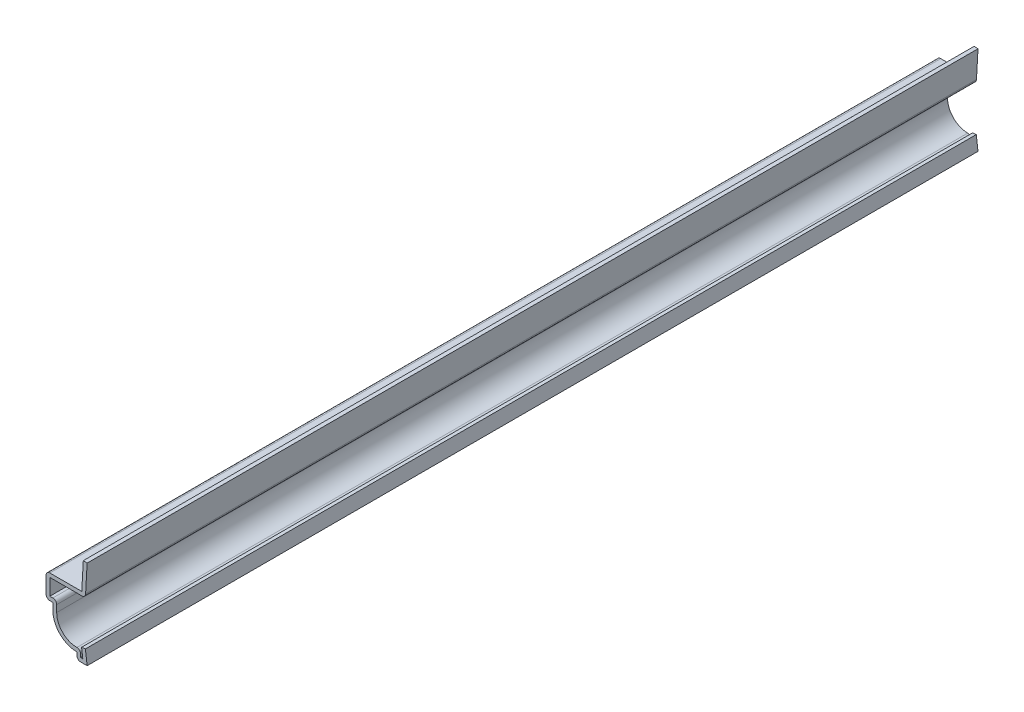
ISO-10303-21;
HEADER;
FILE_DESCRIPTION(('STEP AP214'),'2;1');
FILE_NAME('part.step','',(''),(''),'','','');
FILE_SCHEMA(('AUTOMOTIVE_DESIGN { 1 0 10303 214 1 1 1 1 }'));
ENDSEC;
DATA;
#1=APPLICATION_CONTEXT('core data for automotive mechanical design processes');
#2=APPLICATION_PROTOCOL_DEFINITION('international standard','automotive_design',2000,#1);
#3=PRODUCT_CONTEXT('',#1,'mechanical');
#4=PRODUCT('Part','Part','',(#3));
#5=PRODUCT_RELATED_PRODUCT_CATEGORY('part','',(#4));
#6=PRODUCT_DEFINITION_FORMATION('','',#4);
#7=PRODUCT_DEFINITION_CONTEXT('part definition',#1,'design');
#8=PRODUCT_DEFINITION('design','',#6,#7);
#9=PRODUCT_DEFINITION_SHAPE('','',#8);
#10=(LENGTH_UNIT() NAMED_UNIT(*) SI_UNIT(.MILLI.,.METRE.));
#11=(NAMED_UNIT(*) PLANE_ANGLE_UNIT() SI_UNIT($,.RADIAN.));
#12=(NAMED_UNIT(*) SI_UNIT($,.STERADIAN.) SOLID_ANGLE_UNIT());
#13=UNCERTAINTY_MEASURE_WITH_UNIT(LENGTH_MEASURE(1.E-05),#10,'distance_accuracy_value','');
#14=(GEOMETRIC_REPRESENTATION_CONTEXT(3) GLOBAL_UNCERTAINTY_ASSIGNED_CONTEXT((#13)) GLOBAL_UNIT_ASSIGNED_CONTEXT((#10,
#11,#12)) REPRESENTATION_CONTEXT('',''));
#15=CARTESIAN_POINT('',(0.,0.,0.));
#16=DIRECTION('',(0.,0.,1.));
#17=DIRECTION('',(1.,0.,0.));
#18=AXIS2_PLACEMENT_3D('',#15,#16,#17);
#19=CARTESIAN_POINT('',(-0.396875,3.175,-206.375));
#20=DIRECTION('',(-0.124034734589209,0.992277876713668,0.));
#21=DIRECTION('',(-0.992277876713668,-0.124034734589209,0.));
#22=AXIS2_PLACEMENT_3D('',#19,#20,#21);
#23=PLANE('',#22);
#24=DIRECTION('',(-0.992277876713668,-0.124034734589209,0.));
#25=VECTOR('',#24,1.);
#26=CARTESIAN_POINT('',(-0.396875,3.175,0.));
#27=LINE('',#26,#25);
#28=CARTESIAN_POINT('',(-0.396875,3.175,0.));
#29=VERTEX_POINT('',#28);
#30=CARTESIAN_POINT('',(-1.27901003239845,3.06473312095019,0.));
#31=VERTEX_POINT('',#30);
#32=EDGE_CURVE('E284',#29,#31,#27,.T.);
#33=ORIENTED_EDGE('',*,*,#32,.F.);
#34=DIRECTION('',(0.,0.,1.));
#35=VECTOR('',#34,1.);
#36=CARTESIAN_POINT('',(-0.396875,3.175,-206.375));
#37=LINE('',#36,#35);
#38=CARTESIAN_POINT('',(-0.396875,3.175,-206.375));
#39=VERTEX_POINT('',#38);
#40=EDGE_CURVE('E233',#39,#29,#37,.T.);
#41=ORIENTED_EDGE('',*,*,#40,.F.);
#42=DIRECTION('',(-0.992277876713668,-0.124034734589209,0.));
#43=VECTOR('',#42,1.);
#44=CARTESIAN_POINT('',(-0.396875,3.175,-206.375));
#45=LINE('',#44,#43);
#46=CARTESIAN_POINT('',(-1.27901003239845,3.06473312095019,-206.375));
#47=VERTEX_POINT('',#46);
#48=EDGE_CURVE('E227',#39,#47,#45,.T.);
#49=ORIENTED_EDGE('',*,*,#48,.T.);
#50=DIRECTION('',(0.,0.,1.));
#51=VECTOR('',#50,1.);
#52=CARTESIAN_POINT('',(-1.27901003239845,3.06473312095019,-206.375));
#53=LINE('',#52,#51);
#54=EDGE_CURVE('E209',#47,#31,#53,.T.);
#55=ORIENTED_EDGE('',*,*,#54,.T.);
#56=EDGE_LOOP('',(#33,#41,#49,#55));
#57=FACE_BOUND('',#56,.T.);
#58=ADVANCED_FACE('F35',(#57),#23,.T.);
#59=CARTESIAN_POINT('',(-0.396875,3.175,-206.375));
#60=DIRECTION('',(0.992277876713668,0.124034734589209,0.));
#61=DIRECTION('',(-0.124034734589209,0.992277876713668,0.));
#62=AXIS2_PLACEMENT_3D('',#59,#60,#61);
#63=PLANE('',#62);
#64=DIRECTION('',(-0.124034734589209,0.992277876713668,0.));
#65=VECTOR('',#64,1.);
#66=CARTESIAN_POINT('',(-0.396875,3.175,0.));
#67=LINE('',#66,#65);
#68=CARTESIAN_POINT('',(0.,0.,0.));
#69=VERTEX_POINT('',#68);
#70=EDGE_CURVE('E234',#69,#29,#67,.T.);
#71=ORIENTED_EDGE('',*,*,#70,.F.);
#72=DIRECTION('',(0.,0.,1.));
#73=VECTOR('',#72,1.);
#74=CARTESIAN_POINT('',(0.,0.,-206.375));
#75=LINE('',#74,#73);
#76=CARTESIAN_POINT('',(0.,0.,-206.375));
#77=VERTEX_POINT('',#76);
#78=EDGE_CURVE('E334',#77,#69,#75,.T.);
#79=ORIENTED_EDGE('',*,*,#78,.F.);
#80=DIRECTION('',(-0.124034734589209,0.992277876713668,0.));
#81=VECTOR('',#80,1.);
#82=CARTESIAN_POINT('',(-0.396875,3.175,-206.375));
#83=LINE('',#82,#81);
#84=EDGE_CURVE('E220',#77,#39,#83,.T.);
#85=ORIENTED_EDGE('',*,*,#84,.T.);
#86=ORIENTED_EDGE('',*,*,#40,.T.);
#87=EDGE_LOOP('',(#71,#79,#85,#86));
#88=FACE_BOUND('',#87,.T.);
#89=ADVANCED_FACE('F483',(#88),#63,.T.);
#90=CARTESIAN_POINT('',(0.,0.,-206.375));
#91=DIRECTION('',(0.,-1.,0.));
#92=DIRECTION('',(1.,0.,0.));
#93=AXIS2_PLACEMENT_3D('',#90,#91,#92);
#94=PLANE('',#93);
#95=DIRECTION('',(1.,0.,0.));
#96=VECTOR('',#95,1.);
#97=CARTESIAN_POINT('',(0.,0.,0.));
#98=LINE('',#97,#96);
#99=CARTESIAN_POINT('',(-1.49225,0.,0.));
#100=VERTEX_POINT('',#99);
#101=EDGE_CURVE('E237',#100,#69,#98,.T.);
#102=ORIENTED_EDGE('',*,*,#101,.F.);
#103=DIRECTION('',(0.,0.,1.));
#104=VECTOR('',#103,1.);
#105=CARTESIAN_POINT('',(-1.49225,0.,-206.375));
#106=LINE('',#105,#104);
#107=CARTESIAN_POINT('',(-1.49225,0.,-206.375));
#108=VERTEX_POINT('',#107);
#109=EDGE_CURVE('E392',#100,#108,#106,.F.);
#110=ORIENTED_EDGE('',*,*,#109,.T.);
#111=DIRECTION('',(1.,0.,0.));
#112=VECTOR('',#111,1.);
#113=CARTESIAN_POINT('',(0.,0.,-206.375));
#114=LINE('',#113,#112);
#115=EDGE_CURVE('E281',#108,#77,#114,.T.);
#116=ORIENTED_EDGE('',*,*,#115,.T.);
#117=ORIENTED_EDGE('',*,*,#78,.T.);
#118=EDGE_LOOP('',(#102,#110,#116,#117));
#119=FACE_BOUND('',#118,.T.);
#120=ADVANCED_FACE('F478',(#119),#94,.T.);
#121=CARTESIAN_POINT('',(-2.38125,0.,-206.375));
#122=DIRECTION('',(-1.,0.,0.));
#123=DIRECTION('',(0.,-1.,0.));
#124=AXIS2_PLACEMENT_3D('',#121,#122,#123);
#125=PLANE('',#124);
#126=DIRECTION('',(0.,-1.,0.));
#127=VECTOR('',#126,1.);
#128=CARTESIAN_POINT('',(-2.38125,0.,-206.375));
#129=LINE('',#128,#127);
#130=CARTESIAN_POINT('',(-2.38125,1.5875,-206.375));
#131=VERTEX_POINT('',#130);
#132=CARTESIAN_POINT('',(-2.38125,0.889,-206.375));
#133=VERTEX_POINT('',#132);
#134=EDGE_CURVE('E278',#131,#133,#129,.T.);
#135=ORIENTED_EDGE('',*,*,#134,.T.);
#136=DIRECTION('',(0.,0.,1.));
#137=VECTOR('',#136,1.);
#138=CARTESIAN_POINT('',(-2.38125,0.889,-206.375));
#139=LINE('',#138,#137);
#140=CARTESIAN_POINT('',(-2.38125,0.889,0.));
#141=VERTEX_POINT('',#140);
#142=EDGE_CURVE('E389',#133,#141,#139,.T.);
#143=ORIENTED_EDGE('',*,*,#142,.T.);
#144=DIRECTION('',(0.,-1.,0.));
#145=VECTOR('',#144,1.);
#146=CARTESIAN_POINT('',(-2.38125,0.,0.));
#147=LINE('',#146,#145);
#148=CARTESIAN_POINT('',(-2.38125,1.5875,0.));
#149=VERTEX_POINT('',#148);
#150=EDGE_CURVE('E328',#149,#141,#147,.T.);
#151=ORIENTED_EDGE('',*,*,#150,.F.);
#152=DIRECTION('',(0.,0.,1.));
#153=VECTOR('',#152,1.);
#154=CARTESIAN_POINT('',(-2.38125,1.5875,-206.375));
#155=LINE('',#154,#153);
#156=EDGE_CURVE('E337',#131,#149,#155,.T.);
#157=ORIENTED_EDGE('',*,*,#156,.F.);
#158=EDGE_LOOP('',(#135,#143,#151,#157));
#159=FACE_BOUND('',#158,.T.);
#160=ADVANCED_FACE('F470',(#159),#125,.T.);
#161=CARTESIAN_POINT('',(-2.38125,7.14375,-206.375));
#162=DIRECTION('',(0.,0.,1.));
#163=DIRECTION('',(1.,0.,0.));
#164=AXIS2_PLACEMENT_3D('',#161,#162,#163);
#165=CYLINDRICAL_SURFACE('',#164,5.55625);
#166=CARTESIAN_POINT('',(-2.38125,7.14375,0.));
#167=DIRECTION('',(0.,0.,1.));
#168=DIRECTION('',(-1.,0.,0.));
#169=AXIS2_PLACEMENT_3D('',#166,#167,#168);
#170=CIRCLE('',#169,5.55625);
#171=CARTESIAN_POINT('',(-7.9375,7.14375,0.));
#172=VERTEX_POINT('',#171);
#173=EDGE_CURVE('E325',#172,#149,#170,.T.);
#174=ORIENTED_EDGE('',*,*,#173,.F.);
#175=DIRECTION('',(0.,0.,1.));
#176=VECTOR('',#175,1.);
#177=CARTESIAN_POINT('',(-7.9375,7.14375,-206.375));
#178=LINE('',#177,#176);
#179=CARTESIAN_POINT('',(-7.9375,7.14375,-206.375));
#180=VERTEX_POINT('',#179);
#181=EDGE_CURVE('E339',#180,#172,#178,.T.);
#182=ORIENTED_EDGE('',*,*,#181,.F.);
#183=CARTESIAN_POINT('',(-2.38125,7.14375,-206.375));
#184=DIRECTION('',(0.,0.,1.));
#185=DIRECTION('',(-1.,0.,0.));
#186=AXIS2_PLACEMENT_3D('',#183,#184,#185);
#187=CIRCLE('',#186,5.55625);
#188=EDGE_CURVE('E275',#180,#131,#187,.T.);
#189=ORIENTED_EDGE('',*,*,#188,.T.);
#190=ORIENTED_EDGE('',*,*,#156,.T.);
#191=EDGE_LOOP('',(#174,#182,#189,#190));
#192=FACE_BOUND('',#191,.T.);
#193=ADVANCED_FACE('F466',(#192),#165,.T.);
#194=CARTESIAN_POINT('',(-7.9375,7.14375,-206.375));
#195=DIRECTION('',(-1.,0.,0.));
#196=DIRECTION('',(0.,-1.,0.));
#197=AXIS2_PLACEMENT_3D('',#194,#195,#196);
#198=PLANE('',#197);
#199=DIRECTION('',(0.,-1.,0.));
#200=VECTOR('',#199,1.);
#201=CARTESIAN_POINT('',(-7.9375,7.14375,0.));
#202=LINE('',#201,#200);
#203=CARTESIAN_POINT('',(-7.9375,8.73125,0.));
#204=VERTEX_POINT('',#203);
#205=EDGE_CURVE('E322',#204,#172,#202,.T.);
#206=ORIENTED_EDGE('',*,*,#205,.F.);
#207=DIRECTION('',(0.,0.,1.));
#208=VECTOR('',#207,1.);
#209=CARTESIAN_POINT('',(-7.9375,8.73125,-206.375));
#210=LINE('',#209,#208);
#211=CARTESIAN_POINT('',(-7.9375,8.73125,-206.375));
#212=VERTEX_POINT('',#211);
#213=EDGE_CURVE('E341',#212,#204,#210,.T.);
#214=ORIENTED_EDGE('',*,*,#213,.F.);
#215=DIRECTION('',(0.,-1.,0.));
#216=VECTOR('',#215,1.);
#217=CARTESIAN_POINT('',(-7.9375,7.14375,-206.375));
#218=LINE('',#217,#216);
#219=EDGE_CURVE('E272',#212,#180,#218,.T.);
#220=ORIENTED_EDGE('',*,*,#219,.T.);
#221=ORIENTED_EDGE('',*,*,#181,.T.);
#222=EDGE_LOOP('',(#206,#214,#220,#221));
#223=FACE_BOUND('',#222,.T.);
#224=ADVANCED_FACE('F462',(#223),#198,.T.);
#225=CARTESIAN_POINT('',(-7.9375,8.73125,-206.375));
#226=DIRECTION('',(0.,-1.,0.));
#227=DIRECTION('',(0.,0.,-1.));
#228=AXIS2_PLACEMENT_3D('',#225,#226,#227);
#229=PLANE('',#228);
#230=DIRECTION('',(1.,0.,0.));
#231=VECTOR('',#230,1.);
#232=CARTESIAN_POINT('',(-7.9375,8.73125,0.));
#233=LINE('',#232,#231);
#234=CARTESIAN_POINT('',(-8.636,8.73125,0.));
#235=VERTEX_POINT('',#234);
#236=EDGE_CURVE('E320',#235,#204,#233,.T.);
#237=ORIENTED_EDGE('',*,*,#236,.F.);
#238=DIRECTION('',(0.,0.,1.));
#239=VECTOR('',#238,1.);
#240=CARTESIAN_POINT('',(-8.636,8.73125,-206.375));
#241=LINE('',#240,#239);
#242=CARTESIAN_POINT('',(-8.636,8.73125,-206.375));
#243=VERTEX_POINT('',#242);
#244=EDGE_CURVE('E403',#235,#243,#241,.F.);
#245=ORIENTED_EDGE('',*,*,#244,.T.);
#246=DIRECTION('',(1.,0.,0.));
#247=VECTOR('',#246,1.);
#248=CARTESIAN_POINT('',(-7.9375,8.73125,-206.375));
#249=LINE('',#248,#247);
#250=EDGE_CURVE('E270',#243,#212,#249,.T.);
#251=ORIENTED_EDGE('',*,*,#250,.T.);
#252=ORIENTED_EDGE('',*,*,#213,.T.);
#253=EDGE_LOOP('',(#237,#245,#251,#252));
#254=FACE_BOUND('',#253,.T.);
#255=ADVANCED_FACE('F457',(#254),#229,.T.);
#256=CARTESIAN_POINT('',(-9.525,8.73125,-206.375));
#257=DIRECTION('',(-1.,0.,0.));
#258=DIRECTION('',(0.,-1.,0.));
#259=AXIS2_PLACEMENT_3D('',#256,#257,#258);
#260=PLANE('',#259);
#261=DIRECTION('',(0.,-1.,0.));
#262=VECTOR('',#261,1.);
#263=CARTESIAN_POINT('',(-9.525,8.73125,-206.375));
#264=LINE('',#263,#262);
#265=CARTESIAN_POINT('',(-9.525,13.3985,-206.375));
#266=VERTEX_POINT('',#265);
#267=CARTESIAN_POINT('',(-9.525,9.62025,-206.375));
#268=VERTEX_POINT('',#267);
#269=EDGE_CURVE('E267',#266,#268,#264,.T.);
#270=ORIENTED_EDGE('',*,*,#269,.T.);
#271=DIRECTION('',(0.,0.,1.));
#272=VECTOR('',#271,1.);
#273=CARTESIAN_POINT('',(-9.525,9.62025,-206.375));
#274=LINE('',#273,#272);
#275=CARTESIAN_POINT('',(-9.525,9.62025,0.));
#276=VERTEX_POINT('',#275);
#277=EDGE_CURVE('E400',#268,#276,#274,.T.);
#278=ORIENTED_EDGE('',*,*,#277,.T.);
#279=DIRECTION('',(0.,-1.,0.));
#280=VECTOR('',#279,1.);
#281=CARTESIAN_POINT('',(-9.525,8.73125,0.));
#282=LINE('',#281,#280);
#283=CARTESIAN_POINT('',(-9.525,13.3985,0.));
#284=VERTEX_POINT('',#283);
#285=EDGE_CURVE('E317',#284,#276,#282,.T.);
#286=ORIENTED_EDGE('',*,*,#285,.F.);
#287=DIRECTION('',(0.,0.,1.));
#288=VECTOR('',#287,1.);
#289=CARTESIAN_POINT('',(-9.525,13.3985,-206.375));
#290=LINE('',#289,#288);
#291=EDGE_CURVE('E398',#284,#266,#290,.F.);
#292=ORIENTED_EDGE('',*,*,#291,.T.);
#293=EDGE_LOOP('',(#270,#278,#286,#292));
#294=FACE_BOUND('',#293,.T.);
#295=ADVANCED_FACE('F445',(#294),#260,.T.);
#296=CARTESIAN_POINT('',(-9.525,14.2875,-206.375));
#297=DIRECTION('',(0.,1.,0.));
#298=DIRECTION('',(0.,0.,1.));
#299=AXIS2_PLACEMENT_3D('',#296,#297,#298);
#300=PLANE('',#299);
#301=DIRECTION('',(-1.,0.,0.));
#302=VECTOR('',#301,1.);
#303=CARTESIAN_POINT('',(-9.525,14.2875,-206.375));
#304=LINE('',#303,#302);
#305=CARTESIAN_POINT('',(-1.23815711992532,14.2875,-206.375));
#306=VERTEX_POINT('',#305);
#307=CARTESIAN_POINT('',(-8.636,14.2875,-206.375));
#308=VERTEX_POINT('',#307);
#309=EDGE_CURVE('E264',#306,#308,#304,.T.);
#310=ORIENTED_EDGE('',*,*,#309,.T.);
#311=DIRECTION('',(0.,0.,1.));
#312=VECTOR('',#311,1.);
#313=CARTESIAN_POINT('',(-8.636,14.2875,-206.375));
#314=LINE('',#313,#312);
#315=CARTESIAN_POINT('',(-8.636,14.2875,0.));
#316=VERTEX_POINT('',#315);
#317=EDGE_CURVE('E405',#308,#316,#314,.T.);
#318=ORIENTED_EDGE('',*,*,#317,.T.);
#319=DIRECTION('',(-1.,0.,0.));
#320=VECTOR('',#319,1.);
#321=CARTESIAN_POINT('',(-9.525,14.2875,0.));
#322=LINE('',#321,#320);
#323=CARTESIAN_POINT('',(-1.23815711992532,14.2875,0.));
#324=VERTEX_POINT('',#323);
#325=EDGE_CURVE('E314',#324,#316,#322,.T.);
#326=ORIENTED_EDGE('',*,*,#325,.F.);
#327=DIRECTION('',(0.,0.,1.));
#328=VECTOR('',#327,1.);
#329=CARTESIAN_POINT('',(-1.23815711992532,14.2875,-206.375));
#330=LINE('',#329,#328);
#331=EDGE_CURVE('E344',#306,#324,#330,.T.);
#332=ORIENTED_EDGE('',*,*,#331,.F.);
#333=EDGE_LOOP('',(#310,#318,#326,#332));
#334=FACE_BOUND('',#333,.T.);
#335=ADVANCED_FACE('F439',(#334),#300,.T.);
#336=CARTESIAN_POINT('',(-1.23815711992532,14.2875,-206.375));
#337=DIRECTION('',(-0.998480053642947,0.0551142674556923,0.));
#338=DIRECTION('',(-0.0551142674556923,-0.998480053642947,0.));
#339=AXIS2_PLACEMENT_3D('',#336,#337,#338);
#340=PLANE('',#339);
#341=DIRECTION('',(-0.0551142674556923,-0.998480053642947,0.));
#342=VECTOR('',#341,1.);
#343=CARTESIAN_POINT('',(-1.23815711992532,14.2875,0.));
#344=LINE('',#343,#342);
#345=CARTESIAN_POINT('',(-0.887648767688575,20.6375,0.));
#346=VERTEX_POINT('',#345);
#347=EDGE_CURVE('E311',#346,#324,#344,.T.);
#348=ORIENTED_EDGE('',*,*,#347,.F.);
#349=DIRECTION('',(0.,0.,1.));
#350=VECTOR('',#349,1.);
#351=CARTESIAN_POINT('',(-0.887648767688575,20.6375,-206.375));
#352=LINE('',#351,#350);
#353=CARTESIAN_POINT('',(-0.887648767688575,20.6375,-206.375));
#354=VERTEX_POINT('',#353);
#355=EDGE_CURVE('E346',#354,#346,#352,.T.);
#356=ORIENTED_EDGE('',*,*,#355,.F.);
#357=DIRECTION('',(-0.0551142674556923,-0.998480053642947,0.));
#358=VECTOR('',#357,1.);
#359=CARTESIAN_POINT('',(-1.23815711992532,14.2875,-206.375));
#360=LINE('',#359,#358);
#361=EDGE_CURVE('E261',#354,#306,#360,.T.);
#362=ORIENTED_EDGE('',*,*,#361,.T.);
#363=ORIENTED_EDGE('',*,*,#331,.T.);
#364=EDGE_LOOP('',(#348,#356,#362,#363));
#365=FACE_BOUND('',#364,.T.);
#366=ADVANCED_FACE('F435',(#365),#340,.T.);
#367=CARTESIAN_POINT('',(-0.887648767688575,20.6375,-206.375));
#368=DIRECTION('',(0.055114267455691,0.998480053642947,0.));
#369=DIRECTION('',(-0.998480053642947,0.055114267455691,0.));
#370=AXIS2_PLACEMENT_3D('',#367,#368,#369);
#371=PLANE('',#370);
#372=DIRECTION('',(-0.998480053642947,0.055114267455691,0.));
#373=VECTOR('',#372,1.);
#374=CARTESIAN_POINT('',(-0.887648767688575,20.6375,0.));
#375=LINE('',#374,#373);
#376=CARTESIAN_POINT('',(0.,20.5885034162319,0.));
#377=VERTEX_POINT('',#376);
#378=EDGE_CURVE('E308',#377,#346,#375,.T.);
#379=ORIENTED_EDGE('',*,*,#378,.F.);
#380=DIRECTION('',(0.,0.,1.));
#381=VECTOR('',#380,1.);
#382=CARTESIAN_POINT('',(0.,20.5885034162319,-206.375));
#383=LINE('',#382,#381);
#384=CARTESIAN_POINT('',(0.,20.5885034162319,-206.375));
#385=VERTEX_POINT('',#384);
#386=EDGE_CURVE('E348',#385,#377,#383,.T.);
#387=ORIENTED_EDGE('',*,*,#386,.F.);
#388=DIRECTION('',(-0.998480053642947,0.055114267455691,0.));
#389=VECTOR('',#388,1.);
#390=CARTESIAN_POINT('',(-0.887648767688575,20.6375,-206.375));
#391=LINE('',#390,#389);
#392=EDGE_CURVE('E258',#385,#354,#391,.T.);
#393=ORIENTED_EDGE('',*,*,#392,.T.);
#394=ORIENTED_EDGE('',*,*,#355,.T.);
#395=EDGE_LOOP('',(#379,#387,#393,#394));
#396=FACE_BOUND('',#395,.T.);
#397=ADVANCED_FACE('F432',(#396),#371,.T.);
#398=CARTESIAN_POINT('',(-0.396874999999997,13.3985,-206.375));
#399=DIRECTION('',(0.998480053642947,-0.0551142674556923,0.));
#400=DIRECTION('',(0.0551142674556923,0.998480053642947,0.));
#401=AXIS2_PLACEMENT_3D('',#398,#399,#400);
#402=PLANE('',#401);
#403=DIRECTION('',(0.0551142674556923,0.998480053642947,0.));
#404=VECTOR('',#403,1.);
#405=CARTESIAN_POINT('',(-0.396874999999997,13.3985,0.));
#406=LINE('',#405,#404);
#407=CARTESIAN_POINT('',(-0.35050835223674,14.2385034162319,0.));
#408=VERTEX_POINT('',#407);
#409=EDGE_CURVE('E306',#408,#377,#406,.T.);
#410=ORIENTED_EDGE('',*,*,#409,.F.);
#411=DIRECTION('',(0.,0.,1.));
#412=VECTOR('',#411,1.);
#413=CARTESIAN_POINT('',(-0.35050835223674,14.2385034162319,-206.375));
#414=LINE('',#413,#412);
#415=CARTESIAN_POINT('',(-0.35050835223674,14.2385034162319,-206.375));
#416=VERTEX_POINT('',#415);
#417=EDGE_CURVE('E11',#408,#416,#414,.F.);
#418=ORIENTED_EDGE('',*,*,#417,.T.);
#419=DIRECTION('',(0.0551142674556923,0.998480053642947,0.));
#420=VECTOR('',#419,1.);
#421=CARTESIAN_POINT('',(-0.396874999999997,13.3985,-206.375));
#422=LINE('',#421,#420);
#423=EDGE_CURVE('E256',#416,#385,#422,.T.);
#424=ORIENTED_EDGE('',*,*,#423,.T.);
#425=ORIENTED_EDGE('',*,*,#386,.T.);
#426=EDGE_LOOP('',(#410,#418,#424,#425));
#427=FACE_BOUND('',#426,.T.);
#428=ADVANCED_FACE('F427',(#427),#402,.T.);
#429=CARTESIAN_POINT('',(-8.636,13.3985,-206.375));
#430=DIRECTION('',(0.,-1.,0.));
#431=DIRECTION('',(0.,0.,-1.));
#432=AXIS2_PLACEMENT_3D('',#429,#430,#431);
#433=PLANE('',#432);
#434=DIRECTION('',(1.,0.,0.));
#435=VECTOR('',#434,1.);
#436=CARTESIAN_POINT('',(-8.636,13.3985,-206.375));
#437=LINE('',#436,#435);
#438=CARTESIAN_POINT('',(-8.636,13.3985,-206.375));
#439=VERTEX_POINT('',#438);
#440=CARTESIAN_POINT('',(-1.23815711992532,13.3985,-206.375));
#441=VERTEX_POINT('',#440);
#442=EDGE_CURVE('E253',#439,#441,#437,.T.);
#443=ORIENTED_EDGE('',*,*,#442,.T.);
#444=DIRECTION('',(0.,0.,1.));
#445=VECTOR('',#444,1.);
#446=CARTESIAN_POINT('',(-1.23815711992532,13.3985,-206.375));
#447=LINE('',#446,#445);
#448=CARTESIAN_POINT('',(-1.23815711992532,13.3985,0.));
#449=VERTEX_POINT('',#448);
#450=EDGE_CURVE('E43',#441,#449,#447,.T.);
#451=ORIENTED_EDGE('',*,*,#450,.T.);
#452=DIRECTION('',(1.,0.,0.));
#453=VECTOR('',#452,1.);
#454=CARTESIAN_POINT('',(-8.636,13.3985,0.));
#455=LINE('',#454,#453);
#456=CARTESIAN_POINT('',(-8.636,13.3985,0.));
#457=VERTEX_POINT('',#456);
#458=EDGE_CURVE('E303',#457,#449,#455,.T.);
#459=ORIENTED_EDGE('',*,*,#458,.F.);
#460=DIRECTION('',(0.,0.,1.));
#461=VECTOR('',#460,1.);
#462=CARTESIAN_POINT('',(-8.636,13.3985,-206.375));
#463=LINE('',#462,#461);
#464=EDGE_CURVE('E351',#439,#457,#463,.T.);
#465=ORIENTED_EDGE('',*,*,#464,.F.);
#466=EDGE_LOOP('',(#443,#451,#459,#465));
#467=FACE_BOUND('',#466,.T.);
#468=ADVANCED_FACE('F411',(#467),#433,.T.);
#469=CARTESIAN_POINT('',(-8.636,9.62025,-206.375));
#470=DIRECTION('',(1.,0.,0.));
#471=DIRECTION('',(0.,0.,-1.));
#472=AXIS2_PLACEMENT_3D('',#469,#470,#471);
#473=PLANE('',#472);
#474=DIRECTION('',(0.,1.,0.));
#475=VECTOR('',#474,1.);
#476=CARTESIAN_POINT('',(-8.636,9.62025,0.));
#477=LINE('',#476,#475);
#478=CARTESIAN_POINT('',(-8.636,9.62025,0.));
#479=VERTEX_POINT('',#478);
#480=EDGE_CURVE('E300',#479,#457,#477,.T.);
#481=ORIENTED_EDGE('',*,*,#480,.F.);
#482=DIRECTION('',(0.,0.,1.));
#483=VECTOR('',#482,1.);
#484=CARTESIAN_POINT('',(-8.636,9.62025,-206.375));
#485=LINE('',#484,#483);
#486=CARTESIAN_POINT('',(-8.636,9.62025,-206.375));
#487=VERTEX_POINT('',#486);
#488=EDGE_CURVE('E353',#487,#479,#485,.T.);
#489=ORIENTED_EDGE('',*,*,#488,.F.);
#490=DIRECTION('',(0.,1.,0.));
#491=VECTOR('',#490,1.);
#492=CARTESIAN_POINT('',(-8.636,9.62025,-206.375));
#493=LINE('',#492,#491);
#494=EDGE_CURVE('E250',#487,#439,#493,.T.);
#495=ORIENTED_EDGE('',*,*,#494,.T.);
#496=ORIENTED_EDGE('',*,*,#464,.T.);
#497=EDGE_LOOP('',(#481,#489,#495,#496));
#498=FACE_BOUND('',#497,.T.);
#499=ADVANCED_FACE('F421',(#498),#473,.T.);
#500=CARTESIAN_POINT('',(-7.0485,9.62025,-206.375));
#501=DIRECTION('',(0.,1.,0.));
#502=DIRECTION('',(0.,0.,1.));
#503=AXIS2_PLACEMENT_3D('',#500,#501,#502);
#504=PLANE('',#503);
#505=DIRECTION('',(-1.,0.,0.));
#506=VECTOR('',#505,1.);
#507=CARTESIAN_POINT('',(-7.0485,9.62025,0.));
#508=LINE('',#507,#506);
#509=CARTESIAN_POINT('',(-7.9375,9.62025,0.));
#510=VERTEX_POINT('',#509);
#511=EDGE_CURVE('E298',#510,#479,#508,.T.);
#512=ORIENTED_EDGE('',*,*,#511,.F.);
#513=DIRECTION('',(0.,0.,1.));
#514=VECTOR('',#513,1.);
#515=CARTESIAN_POINT('',(-7.9375,9.62025,-206.375));
#516=LINE('',#515,#514);
#517=CARTESIAN_POINT('',(-7.9375,9.62025,-206.375));
#518=VERTEX_POINT('',#517);
#519=EDGE_CURVE('E58',#510,#518,#516,.F.);
#520=ORIENTED_EDGE('',*,*,#519,.T.);
#521=DIRECTION('',(-1.,0.,0.));
#522=VECTOR('',#521,1.);
#523=CARTESIAN_POINT('',(-7.0485,9.62025,-206.375));
#524=LINE('',#523,#522);
#525=EDGE_CURVE('E248',#518,#487,#524,.T.);
#526=ORIENTED_EDGE('',*,*,#525,.T.);
#527=ORIENTED_EDGE('',*,*,#488,.T.);
#528=EDGE_LOOP('',(#512,#520,#526,#527));
#529=FACE_BOUND('',#528,.T.);
#530=ADVANCED_FACE('F504',(#529),#504,.T.);
#531=CARTESIAN_POINT('',(-7.0485,7.14375,-206.375));
#532=DIRECTION('',(1.,0.,0.));
#533=DIRECTION('',(0.,0.,-1.));
#534=AXIS2_PLACEMENT_3D('',#531,#532,#533);
#535=PLANE('',#534);
#536=DIRECTION('',(0.,1.,0.));
#537=VECTOR('',#536,1.);
#538=CARTESIAN_POINT('',(-7.0485,7.14375,-206.375));
#539=LINE('',#538,#537);
#540=CARTESIAN_POINT('',(-7.0485,7.14375,-206.375));
#541=VERTEX_POINT('',#540);
#542=CARTESIAN_POINT('',(-7.0485,8.73125,-206.375));
#543=VERTEX_POINT('',#542);
#544=EDGE_CURVE('E246',#541,#543,#539,.T.);
#545=ORIENTED_EDGE('',*,*,#544,.T.);
#546=DIRECTION('',(0.,0.,1.));
#547=VECTOR('',#546,1.);
#548=CARTESIAN_POINT('',(-7.0485,8.73125,-206.375));
#549=LINE('',#548,#547);
#550=CARTESIAN_POINT('',(-7.0485,8.73125,0.));
#551=VERTEX_POINT('',#550);
#552=EDGE_CURVE('E394',#543,#551,#549,.T.);
#553=ORIENTED_EDGE('',*,*,#552,.T.);
#554=DIRECTION('',(0.,1.,0.));
#555=VECTOR('',#554,1.);
#556=CARTESIAN_POINT('',(-7.0485,7.14375,0.));
#557=LINE('',#556,#555);
#558=CARTESIAN_POINT('',(-7.0485,7.14375,0.));
#559=VERTEX_POINT('',#558);
#560=EDGE_CURVE('E295',#559,#551,#557,.T.);
#561=ORIENTED_EDGE('',*,*,#560,.F.);
#562=DIRECTION('',(0.,0.,1.));
#563=VECTOR('',#562,1.);
#564=CARTESIAN_POINT('',(-7.0485,7.14375,-206.375));
#565=LINE('',#564,#563);
#566=EDGE_CURVE('E356',#541,#559,#565,.T.);
#567=ORIENTED_EDGE('',*,*,#566,.F.);
#568=EDGE_LOOP('',(#545,#553,#561,#567));
#569=FACE_BOUND('',#568,.T.);
#570=ADVANCED_FACE('F501',(#569),#535,.T.);
#571=CARTESIAN_POINT('',(-2.38125,7.14375,-206.375));
#572=DIRECTION('',(0.,0.,1.));
#573=DIRECTION('',(1.,0.,0.));
#574=AXIS2_PLACEMENT_3D('',#571,#572,#573);
#575=CYLINDRICAL_SURFACE('',#574,4.66725);
#576=CARTESIAN_POINT('',(-2.38125,7.14375,0.));
#577=DIRECTION('',(0.,0.,-1.));
#578=DIRECTION('',(-1.,0.,0.));
#579=AXIS2_PLACEMENT_3D('',#576,#577,#578);
#580=CIRCLE('',#579,4.66725);
#581=CARTESIAN_POINT('',(-2.38125,2.4765,0.));
#582=VERTEX_POINT('',#581);
#583=EDGE_CURVE('E293',#582,#559,#580,.T.);
#584=ORIENTED_EDGE('',*,*,#583,.F.);
#585=DIRECTION('',(0.,0.,1.));
#586=VECTOR('',#585,1.);
#587=CARTESIAN_POINT('',(-2.38125,2.4765,-206.375));
#588=LINE('',#587,#586);
#589=CARTESIAN_POINT('',(-2.38125,2.4765,-206.375));
#590=VERTEX_POINT('',#589);
#591=EDGE_CURVE('E376',#582,#590,#588,.F.);
#592=ORIENTED_EDGE('',*,*,#591,.T.);
#593=CARTESIAN_POINT('',(-2.38125,7.14375,-206.375));
#594=DIRECTION('',(0.,0.,-1.));
#595=DIRECTION('',(-1.,0.,0.));
#596=AXIS2_PLACEMENT_3D('',#593,#594,#595);
#597=CIRCLE('',#596,4.66725);
#598=EDGE_CURVE('E244',#590,#541,#597,.T.);
#599=ORIENTED_EDGE('',*,*,#598,.T.);
#600=ORIENTED_EDGE('',*,*,#566,.T.);
#601=EDGE_LOOP('',(#584,#592,#599,#600));
#602=FACE_BOUND('',#601,.T.);
#603=ADVANCED_FACE('F497',(#602),#575,.F.);
#604=CARTESIAN_POINT('',(-1.49225,0.889,-206.375));
#605=DIRECTION('',(1.,0.,0.));
#606=DIRECTION('',(0.,0.,-1.));
#607=AXIS2_PLACEMENT_3D('',#604,#605,#606);
#608=PLANE('',#607);
#609=DIRECTION('',(0.,1.,0.));
#610=VECTOR('',#609,1.);
#611=CARTESIAN_POINT('',(-1.49225,0.889,-206.375));
#612=LINE('',#611,#610);
#613=CARTESIAN_POINT('',(-1.49225,0.889,-206.375));
#614=VERTEX_POINT('',#613);
#615=CARTESIAN_POINT('',(-1.49225,1.5875,-206.375));
#616=VERTEX_POINT('',#615);
#617=EDGE_CURVE('E241',#614,#616,#612,.T.);
#618=ORIENTED_EDGE('',*,*,#617,.T.);
#619=DIRECTION('',(0.,0.,1.));
#620=VECTOR('',#619,1.);
#621=CARTESIAN_POINT('',(-1.49225,1.5875,-206.375));
#622=LINE('',#621,#620);
#623=CARTESIAN_POINT('',(-1.49225,1.5875,0.));
#624=VERTEX_POINT('',#623);
#625=EDGE_CURVE('E333',#616,#624,#622,.T.);
#626=ORIENTED_EDGE('',*,*,#625,.T.);
#627=DIRECTION('',(0.,1.,0.));
#628=VECTOR('',#627,1.);
#629=CARTESIAN_POINT('',(-1.49225,0.889,0.));
#630=LINE('',#629,#628);
#631=CARTESIAN_POINT('',(-1.49225,0.889,0.));
#632=VERTEX_POINT('',#631);
#633=EDGE_CURVE('E290',#632,#624,#630,.T.);
#634=ORIENTED_EDGE('',*,*,#633,.F.);
#635=DIRECTION('',(0.,0.,1.));
#636=VECTOR('',#635,1.);
#637=CARTESIAN_POINT('',(-1.49225,0.889,-206.375));
#638=LINE('',#637,#636);
#639=EDGE_CURVE('E359',#614,#632,#638,.T.);
#640=ORIENTED_EDGE('',*,*,#639,.F.);
#641=EDGE_LOOP('',(#618,#626,#634,#640));
#642=FACE_BOUND('',#641,.T.);
#643=ADVANCED_FACE('F489',(#642),#608,.T.);
#644=CARTESIAN_POINT('',(-1.00704339227968,0.889,-206.375));
#645=DIRECTION('',(0.,1.,0.));
#646=DIRECTION('',(0.,0.,1.));
#647=AXIS2_PLACEMENT_3D('',#644,#645,#646);
#648=PLANE('',#647);
#649=DIRECTION('',(-1.,0.,0.));
#650=VECTOR('',#649,1.);
#651=CARTESIAN_POINT('',(-1.00704339227968,0.889,0.));
#652=LINE('',#651,#650);
#653=CARTESIAN_POINT('',(-1.00704339227968,0.889,0.));
#654=VERTEX_POINT('',#653);
#655=EDGE_CURVE('E287',#654,#632,#652,.T.);
#656=ORIENTED_EDGE('',*,*,#655,.F.);
#657=DIRECTION('',(0.,0.,1.));
#658=VECTOR('',#657,1.);
#659=CARTESIAN_POINT('',(-1.00704339227968,0.889,-206.375));
#660=LINE('',#659,#658);
#661=CARTESIAN_POINT('',(-1.00704339227968,0.889,-206.375));
#662=VERTEX_POINT('',#661);
#663=EDGE_CURVE('E219',#662,#654,#660,.T.);
#664=ORIENTED_EDGE('',*,*,#663,.F.);
#665=DIRECTION('',(-1.,0.,0.));
#666=VECTOR('',#665,1.);
#667=CARTESIAN_POINT('',(-1.00704339227968,0.889,-206.375));
#668=LINE('',#667,#666);
#669=EDGE_CURVE('E231',#662,#614,#668,.T.);
#670=ORIENTED_EDGE('',*,*,#669,.T.);
#671=ORIENTED_EDGE('',*,*,#639,.T.);
#672=EDGE_LOOP('',(#656,#664,#670,#671));
#673=FACE_BOUND('',#672,.T.);
#674=ADVANCED_FACE('F487',(#673),#648,.T.);
#675=CARTESIAN_POINT('',(-1.27901003239845,3.06473312095019,-206.375));
#676=DIRECTION('',(-0.992277876713668,-0.124034734589209,0.));
#677=DIRECTION('',(0.124034734589209,-0.992277876713668,0.));
#678=AXIS2_PLACEMENT_3D('',#675,#676,#677);
#679=PLANE('',#678);
#680=DIRECTION('',(0.124034734589209,-0.992277876713668,0.));
#681=VECTOR('',#680,1.);
#682=CARTESIAN_POINT('',(-1.27901003239845,3.06473312095019,0.));
#683=LINE('',#682,#681);
#684=EDGE_CURVE('E214',#31,#654,#683,.T.);
#685=ORIENTED_EDGE('',*,*,#684,.F.);
#686=ORIENTED_EDGE('',*,*,#54,.F.);
#687=DIRECTION('',(0.124034734589209,-0.992277876713668,0.));
#688=VECTOR('',#687,1.);
#689=CARTESIAN_POINT('',(-1.27901003239845,3.06473312095019,-206.375));
#690=LINE('',#689,#688);
#691=EDGE_CURVE('E212',#47,#662,#690,.T.);
#692=ORIENTED_EDGE('',*,*,#691,.T.);
#693=ORIENTED_EDGE('',*,*,#663,.T.);
#694=EDGE_LOOP('',(#685,#686,#692,#693));
#695=FACE_BOUND('',#694,.T.);
#696=ADVANCED_FACE('F211',(#695),#679,.T.);
#697=CARTESIAN_POINT('',(-2.38125,7.14375,-206.375));
#698=DIRECTION('',(0.,0.,-1.));
#699=DIRECTION('',(-1.,0.,0.));
#700=AXIS2_PLACEMENT_3D('',#697,#698,#699);
#701=PLANE('',#700);
#702=ORIENTED_EDGE('',*,*,#598,.F.);
#703=CARTESIAN_POINT('',(-2.38125,1.5875,-206.375));
#704=DIRECTION('',(0.,0.,-1.));
#705=DIRECTION('',(-1.,0.,0.));
#706=AXIS2_PLACEMENT_3D('',#703,#704,#705);
#707=CIRCLE('',#706,0.889);
#708=EDGE_CURVE('E387',#590,#616,#707,.T.);
#709=ORIENTED_EDGE('',*,*,#708,.T.);
#710=ORIENTED_EDGE('',*,*,#617,.F.);
#711=ORIENTED_EDGE('',*,*,#669,.F.);
#712=ORIENTED_EDGE('',*,*,#691,.F.);
#713=ORIENTED_EDGE('',*,*,#48,.F.);
#714=ORIENTED_EDGE('',*,*,#84,.F.);
#715=ORIENTED_EDGE('',*,*,#115,.F.);
#716=CARTESIAN_POINT('',(-1.49225,0.889,-206.375));
#717=DIRECTION('',(0.,0.,-1.));
#718=DIRECTION('',(-1.,0.,0.));
#719=AXIS2_PLACEMENT_3D('',#716,#717,#718);
#720=CIRCLE('',#719,0.889);
#721=EDGE_CURVE('E385',#108,#133,#720,.T.);
#722=ORIENTED_EDGE('',*,*,#721,.T.);
#723=ORIENTED_EDGE('',*,*,#134,.F.);
#724=ORIENTED_EDGE('',*,*,#188,.F.);
#725=ORIENTED_EDGE('',*,*,#219,.F.);
#726=ORIENTED_EDGE('',*,*,#250,.F.);
#727=CARTESIAN_POINT('',(-8.636,9.62025,-206.375));
#728=DIRECTION('',(0.,0.,-1.));
#729=DIRECTION('',(-1.,0.,0.));
#730=AXIS2_PLACEMENT_3D('',#727,#728,#729);
#731=CIRCLE('',#730,0.889);
#732=EDGE_CURVE('E382',#243,#268,#731,.T.);
#733=ORIENTED_EDGE('',*,*,#732,.T.);
#734=ORIENTED_EDGE('',*,*,#269,.F.);
#735=CARTESIAN_POINT('',(-8.636,13.3985,-206.375));
#736=DIRECTION('',(0.,0.,-1.));
#737=DIRECTION('',(-1.,0.,0.));
#738=AXIS2_PLACEMENT_3D('',#735,#736,#737);
#739=CIRCLE('',#738,0.889);
#740=EDGE_CURVE('E380',#266,#308,#739,.T.);
#741=ORIENTED_EDGE('',*,*,#740,.T.);
#742=ORIENTED_EDGE('',*,*,#309,.F.);
#743=ORIENTED_EDGE('',*,*,#361,.F.);
#744=ORIENTED_EDGE('',*,*,#392,.F.);
#745=ORIENTED_EDGE('',*,*,#423,.F.);
#746=CARTESIAN_POINT('',(-1.23815711992532,14.2875,-206.375));
#747=DIRECTION('',(0.,0.,-1.));
#748=DIRECTION('',(-1.,0.,0.));
#749=AXIS2_PLACEMENT_3D('',#746,#747,#748);
#750=CIRCLE('',#749,0.889);
#751=EDGE_CURVE('E378',#416,#441,#750,.T.);
#752=ORIENTED_EDGE('',*,*,#751,.T.);
#753=ORIENTED_EDGE('',*,*,#442,.F.);
#754=ORIENTED_EDGE('',*,*,#494,.F.);
#755=ORIENTED_EDGE('',*,*,#525,.F.);
#756=CARTESIAN_POINT('',(-7.9375,8.73125,-206.375));
#757=DIRECTION('',(0.,0.,-1.));
#758=DIRECTION('',(-1.,0.,0.));
#759=AXIS2_PLACEMENT_3D('',#756,#757,#758);
#760=CIRCLE('',#759,0.889);
#761=EDGE_CURVE('E50',#518,#543,#760,.T.);
#762=ORIENTED_EDGE('',*,*,#761,.T.);
#763=ORIENTED_EDGE('',*,*,#544,.F.);
#764=EDGE_LOOP('',(#702,#709,#710,#711,#712,#713,#714,#715,#722,#723,#724,#725,#726,#733,#734,
#741,#742,#743,#744,#745,#752,#753,#754,#755,#762,#763));
#765=FACE_BOUND('',#764,.T.);
#766=ADVANCED_FACE('F225',(#765),#701,.T.);
#767=CARTESIAN_POINT('',(-2.38125,7.14375,0.));
#768=DIRECTION('',(0.,0.,-1.));
#769=DIRECTION('',(-1.,0.,0.));
#770=AXIS2_PLACEMENT_3D('',#767,#768,#769);
#771=PLANE('',#770);
#772=ORIENTED_EDGE('',*,*,#633,.T.);
#773=CARTESIAN_POINT('',(-2.38125,1.5875,0.));
#774=DIRECTION('',(0.,0.,-1.));
#775=DIRECTION('',(-1.,0.,0.));
#776=AXIS2_PLACEMENT_3D('',#773,#774,#775);
#777=CIRCLE('',#776,0.889);
#778=EDGE_CURVE('E374',#624,#582,#777,.F.);
#779=ORIENTED_EDGE('',*,*,#778,.T.);
#780=ORIENTED_EDGE('',*,*,#583,.T.);
#781=ORIENTED_EDGE('',*,*,#560,.T.);
#782=CARTESIAN_POINT('',(-7.9375,8.73125,0.));
#783=DIRECTION('',(0.,0.,-1.));
#784=DIRECTION('',(-1.,0.,0.));
#785=AXIS2_PLACEMENT_3D('',#782,#783,#784);
#786=CIRCLE('',#785,0.889);
#787=EDGE_CURVE('E370',#551,#510,#786,.F.);
#788=ORIENTED_EDGE('',*,*,#787,.T.);
#789=ORIENTED_EDGE('',*,*,#511,.T.);
#790=ORIENTED_EDGE('',*,*,#480,.T.);
#791=ORIENTED_EDGE('',*,*,#458,.T.);
#792=CARTESIAN_POINT('',(-1.23815711992532,14.2875,0.));
#793=DIRECTION('',(0.,0.,-1.));
#794=DIRECTION('',(-1.,0.,0.));
#795=AXIS2_PLACEMENT_3D('',#792,#793,#794);
#796=CIRCLE('',#795,0.889);
#797=EDGE_CURVE('E364',#449,#408,#796,.F.);
#798=ORIENTED_EDGE('',*,*,#797,.T.);
#799=ORIENTED_EDGE('',*,*,#409,.T.);
#800=ORIENTED_EDGE('',*,*,#378,.T.);
#801=ORIENTED_EDGE('',*,*,#347,.T.);
#802=ORIENTED_EDGE('',*,*,#325,.T.);
#803=CARTESIAN_POINT('',(-8.636,13.3985,0.));
#804=DIRECTION('',(0.,0.,-1.));
#805=DIRECTION('',(-1.,0.,0.));
#806=AXIS2_PLACEMENT_3D('',#803,#804,#805);
#807=CIRCLE('',#806,0.889);
#808=EDGE_CURVE('E366',#316,#284,#807,.F.);
#809=ORIENTED_EDGE('',*,*,#808,.T.);
#810=ORIENTED_EDGE('',*,*,#285,.T.);
#811=CARTESIAN_POINT('',(-8.636,9.62025,0.));
#812=DIRECTION('',(0.,0.,-1.));
#813=DIRECTION('',(-1.,0.,0.));
#814=AXIS2_PLACEMENT_3D('',#811,#812,#813);
#815=CIRCLE('',#814,0.889);
#816=EDGE_CURVE('E368',#276,#235,#815,.F.);
#817=ORIENTED_EDGE('',*,*,#816,.T.);
#818=ORIENTED_EDGE('',*,*,#236,.T.);
#819=ORIENTED_EDGE('',*,*,#205,.T.);
#820=ORIENTED_EDGE('',*,*,#173,.T.);
#821=ORIENTED_EDGE('',*,*,#150,.T.);
#822=CARTESIAN_POINT('',(-1.49225,0.889,0.));
#823=DIRECTION('',(0.,0.,-1.));
#824=DIRECTION('',(-1.,0.,0.));
#825=AXIS2_PLACEMENT_3D('',#822,#823,#824);
#826=CIRCLE('',#825,0.889);
#827=EDGE_CURVE('E372',#141,#100,#826,.F.);
#828=ORIENTED_EDGE('',*,*,#827,.T.);
#829=ORIENTED_EDGE('',*,*,#101,.T.);
#830=ORIENTED_EDGE('',*,*,#70,.T.);
#831=ORIENTED_EDGE('',*,*,#32,.T.);
#832=ORIENTED_EDGE('',*,*,#684,.T.);
#833=ORIENTED_EDGE('',*,*,#655,.T.);
#834=EDGE_LOOP('',(#772,#779,#780,#781,#788,#789,#790,#791,#798,#799,#800,#801,#802,#809,#810,
#817,#818,#819,#820,#821,#828,#829,#830,#831,#832,#833));
#835=FACE_BOUND('',#834,.T.);
#836=ADVANCED_FACE('F416',(#835),#771,.F.);
#837=CARTESIAN_POINT('',(-2.38125,1.5875,-206.375));
#838=DIRECTION('',(0.,0.,1.));
#839=DIRECTION('',(1.,0.,0.));
#840=AXIS2_PLACEMENT_3D('',#837,#838,#839);
#841=CYLINDRICAL_SURFACE('',#840,0.889);
#842=ORIENTED_EDGE('',*,*,#708,.F.);
#843=ORIENTED_EDGE('',*,*,#591,.F.);
#844=ORIENTED_EDGE('',*,*,#778,.F.);
#845=ORIENTED_EDGE('',*,*,#625,.F.);
#846=EDGE_LOOP('',(#842,#843,#844,#845));
#847=FACE_BOUND('',#846,.T.);
#848=ADVANCED_FACE('F493',(#847),#841,.T.);
#849=CARTESIAN_POINT('',(-1.49225,0.889,-206.375));
#850=DIRECTION('',(0.,0.,1.));
#851=DIRECTION('',(1.,0.,0.));
#852=AXIS2_PLACEMENT_3D('',#849,#850,#851);
#853=CYLINDRICAL_SURFACE('',#852,0.889);
#854=ORIENTED_EDGE('',*,*,#721,.F.);
#855=ORIENTED_EDGE('',*,*,#109,.F.);
#856=ORIENTED_EDGE('',*,*,#827,.F.);
#857=ORIENTED_EDGE('',*,*,#142,.F.);
#858=EDGE_LOOP('',(#854,#855,#856,#857));
#859=FACE_BOUND('',#858,.T.);
#860=ADVANCED_FACE('F474',(#859),#853,.T.);
#861=CARTESIAN_POINT('',(-7.9375,8.73125,-206.375));
#862=DIRECTION('',(0.,0.,1.));
#863=DIRECTION('',(1.,0.,0.));
#864=AXIS2_PLACEMENT_3D('',#861,#862,#863);
#865=CYLINDRICAL_SURFACE('',#864,0.889);
#866=ORIENTED_EDGE('',*,*,#761,.F.);
#867=ORIENTED_EDGE('',*,*,#519,.F.);
#868=ORIENTED_EDGE('',*,*,#787,.F.);
#869=ORIENTED_EDGE('',*,*,#552,.F.);
#870=EDGE_LOOP('',(#866,#867,#868,#869));
#871=FACE_BOUND('',#870,.T.);
#872=ADVANCED_FACE('F505',(#871),#865,.T.);
#873=CARTESIAN_POINT('',(-8.636,9.62025,-206.375));
#874=DIRECTION('',(0.,0.,1.));
#875=DIRECTION('',(1.,0.,0.));
#876=AXIS2_PLACEMENT_3D('',#873,#874,#875);
#877=CYLINDRICAL_SURFACE('',#876,0.889);
#878=ORIENTED_EDGE('',*,*,#732,.F.);
#879=ORIENTED_EDGE('',*,*,#244,.F.);
#880=ORIENTED_EDGE('',*,*,#816,.F.);
#881=ORIENTED_EDGE('',*,*,#277,.F.);
#882=EDGE_LOOP('',(#878,#879,#880,#881));
#883=FACE_BOUND('',#882,.T.);
#884=ADVANCED_FACE('F453',(#883),#877,.T.);
#885=CARTESIAN_POINT('',(-8.636,13.3985,-206.375));
#886=DIRECTION('',(0.,0.,1.));
#887=DIRECTION('',(1.,0.,0.));
#888=AXIS2_PLACEMENT_3D('',#885,#886,#887);
#889=CYLINDRICAL_SURFACE('',#888,0.889);
#890=ORIENTED_EDGE('',*,*,#740,.F.);
#891=ORIENTED_EDGE('',*,*,#291,.F.);
#892=ORIENTED_EDGE('',*,*,#808,.F.);
#893=ORIENTED_EDGE('',*,*,#317,.F.);
#894=EDGE_LOOP('',(#890,#891,#892,#893));
#895=FACE_BOUND('',#894,.T.);
#896=ADVANCED_FACE('F449',(#895),#889,.T.);
#897=CARTESIAN_POINT('',(-1.23815711992532,14.2875,-206.375));
#898=DIRECTION('',(0.,0.,1.));
#899=DIRECTION('',(1.,0.,0.));
#900=AXIS2_PLACEMENT_3D('',#897,#898,#899);
#901=CYLINDRICAL_SURFACE('',#900,0.889);
#902=ORIENTED_EDGE('',*,*,#751,.F.);
#903=ORIENTED_EDGE('',*,*,#417,.F.);
#904=ORIENTED_EDGE('',*,*,#797,.F.);
#905=ORIENTED_EDGE('',*,*,#450,.F.);
#906=EDGE_LOOP('',(#902,#903,#904,#905));
#907=FACE_BOUND('',#906,.T.);
#908=ADVANCED_FACE('F37',(#907),#901,.T.);
#909=CLOSED_SHELL('',(#58,#89,#120,#160,#193,#224,#255,#295,#335,#366,#397,#428,#468,#499,#530,
#570,#603,#643,#674,#696,#766,#836,#848,#860,#872,#884,#896,#908));
#910=MANIFOLD_SOLID_BREP('B2',#909);
#911=ADVANCED_BREP_SHAPE_REPRESENTATION('',(#18,#910),#14);
#912=SHAPE_DEFINITION_REPRESENTATION(#9,#911);
ENDSEC;
END-ISO-10303-21;
